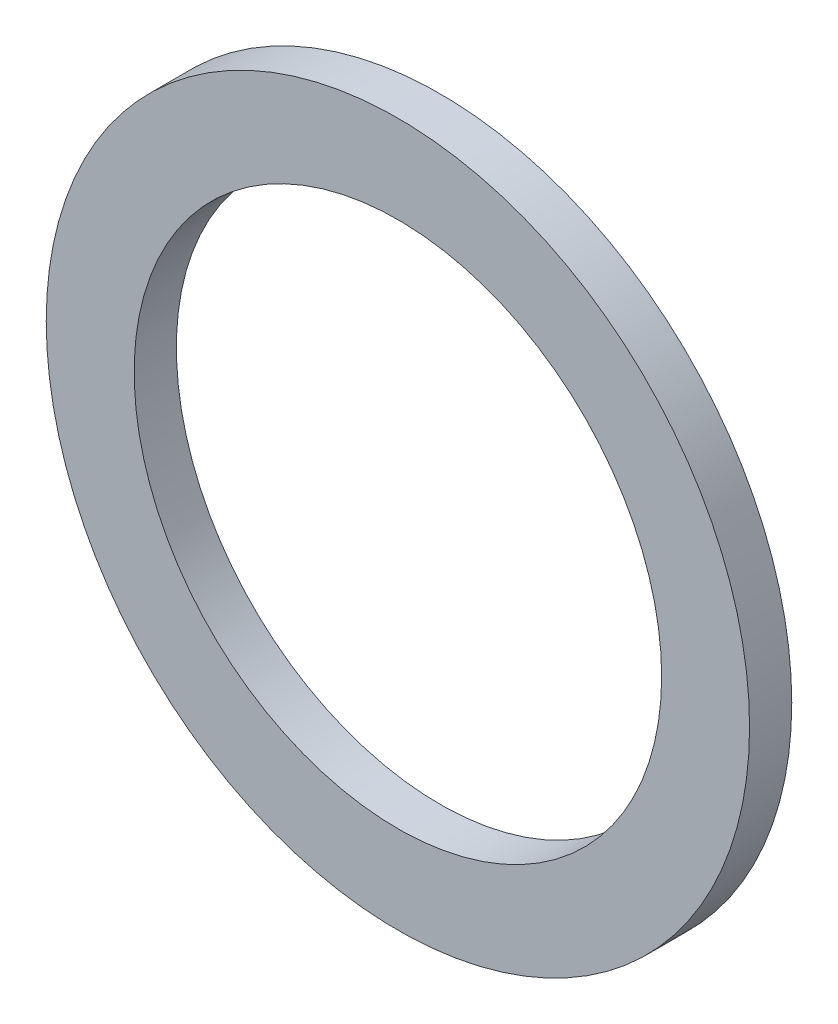
ISO-10303-21;
HEADER;
FILE_DESCRIPTION(('STEP AP214'),'2;1');
FILE_NAME('part.step','',(''),(''),'','','');
FILE_SCHEMA(('AUTOMOTIVE_DESIGN { 1 0 10303 214 1 1 1 1 }'));
ENDSEC;
DATA;
#1=APPLICATION_CONTEXT('core data for automotive mechanical design processes');
#2=APPLICATION_PROTOCOL_DEFINITION('international standard','automotive_design',2000,#1);
#3=PRODUCT_CONTEXT('',#1,'mechanical');
#4=PRODUCT('Part','Part','',(#3));
#5=PRODUCT_RELATED_PRODUCT_CATEGORY('part','',(#4));
#6=PRODUCT_DEFINITION_FORMATION('','',#4);
#7=PRODUCT_DEFINITION_CONTEXT('part definition',#1,'design');
#8=PRODUCT_DEFINITION('design','',#6,#7);
#9=PRODUCT_DEFINITION_SHAPE('','',#8);
#10=(LENGTH_UNIT() NAMED_UNIT(*) SI_UNIT(.MILLI.,.METRE.));
#11=(NAMED_UNIT(*) PLANE_ANGLE_UNIT() SI_UNIT($,.RADIAN.));
#12=(NAMED_UNIT(*) SI_UNIT($,.STERADIAN.) SOLID_ANGLE_UNIT());
#13=UNCERTAINTY_MEASURE_WITH_UNIT(LENGTH_MEASURE(1.E-05),#10,'distance_accuracy_value','');
#14=(GEOMETRIC_REPRESENTATION_CONTEXT(3) GLOBAL_UNCERTAINTY_ASSIGNED_CONTEXT((#13)) GLOBAL_UNIT_ASSIGNED_CONTEXT((#10,
#11,#12)) REPRESENTATION_CONTEXT('',''));
#15=CARTESIAN_POINT('',(0.,0.,0.));
#16=DIRECTION('',(0.,0.,1.));
#17=DIRECTION('',(1.,0.,0.));
#18=AXIS2_PLACEMENT_3D('',#15,#16,#17);
#19=CARTESIAN_POINT('',(0.,0.,1.2));
#20=DIRECTION('',(0.,0.,1.));
#21=DIRECTION('',(1.,0.,0.));
#22=AXIS2_PLACEMENT_3D('',#19,#20,#21);
#23=PLANE('',#22);
#24=CARTESIAN_POINT('',(0.,0.,1.2));
#25=DIRECTION('',(0.,0.,1.));
#26=DIRECTION('',(1.,0.,0.));
#27=AXIS2_PLACEMENT_3D('',#24,#25,#26);
#28=CIRCLE('',#27,10.);
#29=CARTESIAN_POINT('',(10.,0.,1.2));
#30=VERTEX_POINT('',#29);
#31=EDGE_CURVE('E10',#30,#30,#28,.T.);
#32=ORIENTED_EDGE('',*,*,#31,.T.);
#33=EDGE_LOOP('',(#32));
#34=FACE_BOUND('',#33,.T.);
#35=CARTESIAN_POINT('',(0.,0.,1.2));
#36=DIRECTION('',(0.,0.,1.));
#37=DIRECTION('',(1.,0.,0.));
#38=AXIS2_PLACEMENT_3D('',#35,#36,#37);
#39=CIRCLE('',#38,7.5);
#40=CARTESIAN_POINT('',(7.5,0.,1.2));
#41=VERTEX_POINT('',#40);
#42=EDGE_CURVE('E41',#41,#41,#39,.T.);
#43=ORIENTED_EDGE('',*,*,#42,.F.);
#44=EDGE_LOOP('',(#43));
#45=FACE_BOUND('',#44,.T.);
#46=ADVANCED_FACE('F30',(#34,#45),#23,.T.);
#47=CARTESIAN_POINT('',(0.,0.,0.));
#48=DIRECTION('',(0.,0.,1.));
#49=DIRECTION('',(1.,0.,0.));
#50=AXIS2_PLACEMENT_3D('',#47,#48,#49);
#51=PLANE('',#50);
#52=CARTESIAN_POINT('',(0.,0.,0.));
#53=DIRECTION('',(0.,0.,1.));
#54=DIRECTION('',(1.,0.,0.));
#55=AXIS2_PLACEMENT_3D('',#52,#53,#54);
#56=CIRCLE('',#55,10.);
#57=CARTESIAN_POINT('',(10.,0.,0.));
#58=VERTEX_POINT('',#57);
#59=EDGE_CURVE('E34',#58,#58,#56,.T.);
#60=ORIENTED_EDGE('',*,*,#59,.F.);
#61=EDGE_LOOP('',(#60));
#62=FACE_BOUND('',#61,.T.);
#63=CARTESIAN_POINT('',(0.,0.,0.));
#64=DIRECTION('',(0.,0.,1.));
#65=DIRECTION('',(1.,0.,0.));
#66=AXIS2_PLACEMENT_3D('',#63,#64,#65);
#67=CIRCLE('',#66,7.5);
#68=CARTESIAN_POINT('',(7.5,0.,0.));
#69=VERTEX_POINT('',#68);
#70=EDGE_CURVE('E43',#69,#69,#67,.T.);
#71=ORIENTED_EDGE('',*,*,#70,.T.);
#72=EDGE_LOOP('',(#71));
#73=FACE_BOUND('',#72,.T.);
#74=ADVANCED_FACE('F53',(#62,#73),#51,.F.);
#75=CARTESIAN_POINT('',(0.,0.,1.2));
#76=DIRECTION('',(0.,0.,-1.));
#77=DIRECTION('',(-1.,0.,0.));
#78=AXIS2_PLACEMENT_3D('',#75,#76,#77);
#79=CYLINDRICAL_SURFACE('',#78,10.);
#80=ORIENTED_EDGE('',*,*,#31,.F.);
#81=EDGE_LOOP('',(#80));
#82=FACE_BOUND('',#81,.T.);
#83=ORIENTED_EDGE('',*,*,#59,.T.);
#84=EDGE_LOOP('',(#83));
#85=FACE_BOUND('',#84,.T.);
#86=ADVANCED_FACE('F32',(#82,#85),#79,.T.);
#87=CARTESIAN_POINT('',(0.,0.,1.2));
#88=DIRECTION('',(0.,0.,-1.));
#89=DIRECTION('',(-1.,0.,0.));
#90=AXIS2_PLACEMENT_3D('',#87,#88,#89);
#91=CYLINDRICAL_SURFACE('',#90,7.5);
#92=ORIENTED_EDGE('',*,*,#42,.T.);
#93=EDGE_LOOP('',(#92));
#94=FACE_BOUND('',#93,.T.);
#95=ORIENTED_EDGE('',*,*,#70,.F.);
#96=EDGE_LOOP('',(#95));
#97=FACE_BOUND('',#96,.T.);
#98=ADVANCED_FACE('F49',(#94,#97),#91,.F.);
#99=CLOSED_SHELL('',(#46,#74,#86,#98));
#100=MANIFOLD_SOLID_BREP('B2',#99);
#101=ADVANCED_BREP_SHAPE_REPRESENTATION('',(#18,#100),#14);
#102=SHAPE_DEFINITION_REPRESENTATION(#9,#101);
ENDSEC;
END-ISO-10303-21;
